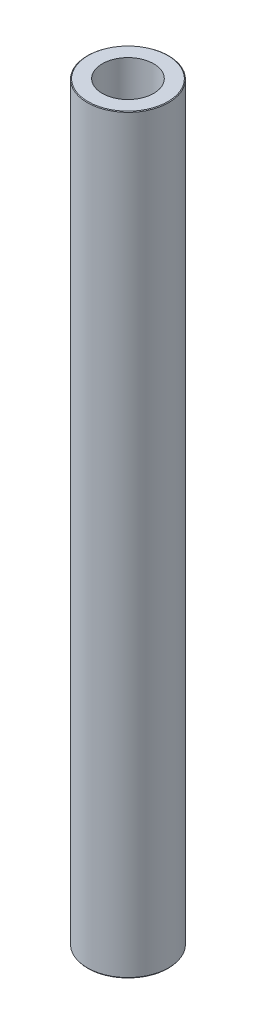
ISO-10303-21;
HEADER;
FILE_DESCRIPTION(('STEP AP214'),'2;1');
FILE_NAME('part.step','',(''),(''),'','','');
FILE_SCHEMA(('AUTOMOTIVE_DESIGN { 1 0 10303 214 1 1 1 1 }'));
ENDSEC;
DATA;
#1=APPLICATION_CONTEXT('core data for automotive mechanical design processes');
#2=APPLICATION_PROTOCOL_DEFINITION('international standard','automotive_design',2000,#1);
#3=PRODUCT_CONTEXT('',#1,'mechanical');
#4=PRODUCT('Part','Part','',(#3));
#5=PRODUCT_RELATED_PRODUCT_CATEGORY('part','',(#4));
#6=PRODUCT_DEFINITION_FORMATION('','',#4);
#7=PRODUCT_DEFINITION_CONTEXT('part definition',#1,'design');
#8=PRODUCT_DEFINITION('design','',#6,#7);
#9=PRODUCT_DEFINITION_SHAPE('','',#8);
#10=(LENGTH_UNIT() NAMED_UNIT(*) SI_UNIT(.MILLI.,.METRE.));
#11=(NAMED_UNIT(*) PLANE_ANGLE_UNIT() SI_UNIT($,.RADIAN.));
#12=(NAMED_UNIT(*) SI_UNIT($,.STERADIAN.) SOLID_ANGLE_UNIT());
#13=UNCERTAINTY_MEASURE_WITH_UNIT(LENGTH_MEASURE(1.E-05),#10,'distance_accuracy_value','');
#14=(GEOMETRIC_REPRESENTATION_CONTEXT(3) GLOBAL_UNCERTAINTY_ASSIGNED_CONTEXT((#13)) GLOBAL_UNIT_ASSIGNED_CONTEXT((#10,
#11,#12)) REPRESENTATION_CONTEXT('',''));
#15=CARTESIAN_POINT('',(0.,0.,0.));
#16=DIRECTION('',(0.,0.,1.));
#17=DIRECTION('',(1.,0.,0.));
#18=AXIS2_PLACEMENT_3D('',#15,#16,#17);
#19=CARTESIAN_POINT('',(0.,600.,0.));
#20=DIRECTION('',(0.,-1.,0.));
#21=DIRECTION('',(0.,0.,-1.));
#22=AXIS2_PLACEMENT_3D('',#19,#20,#21);
#23=CYLINDRICAL_SURFACE('',#22,32.5);
#24=CARTESIAN_POINT('',(0.,599.567925164357,0.));
#25=DIRECTION('',(0.,1.,0.));
#26=DIRECTION('',(0.,0.,1.));
#27=AXIS2_PLACEMENT_3D('',#24,#25,#26);
#28=CIRCLE('',#27,32.5);
#29=CARTESIAN_POINT('',(0.,599.567925164357,32.5));
#30=VERTEX_POINT('',#29);
#31=EDGE_CURVE('E50',#30,#30,#28,.F.);
#32=ORIENTED_EDGE('',*,*,#31,.T.);
#33=EDGE_LOOP('',(#32));
#34=FACE_BOUND('',#33,.T.);
#35=CARTESIAN_POINT('',(0.,0.597846862721241,0.));
#36=DIRECTION('',(0.,1.,0.));
#37=DIRECTION('',(0.,0.,1.));
#38=AXIS2_PLACEMENT_3D('',#35,#36,#37);
#39=CIRCLE('',#38,32.5);
#40=CARTESIAN_POINT('',(0.,0.597846862721241,32.5));
#41=VERTEX_POINT('',#40);
#42=EDGE_CURVE('E51',#41,#41,#39,.T.);
#43=ORIENTED_EDGE('',*,*,#42,.T.);
#44=EDGE_LOOP('',(#43));
#45=FACE_BOUND('',#44,.T.);
#46=ADVANCED_FACE('F39',(#34,#45),#23,.T.);
#47=CARTESIAN_POINT('',(0.,600.,0.));
#48=DIRECTION('',(0.,1.,0.));
#49=DIRECTION('',(0.,0.,1.));
#50=AXIS2_PLACEMENT_3D('',#47,#48,#49);
#51=PLANE('',#50);
#52=CARTESIAN_POINT('',(0.,600.,0.));
#53=DIRECTION('',(0.,1.,0.));
#54=DIRECTION('',(0.,0.,1.));
#55=AXIS2_PLACEMENT_3D('',#52,#53,#54);
#56=CIRCLE('',#55,31.9021531372786);
#57=CARTESIAN_POINT('',(0.,600.,31.9021531372786));
#58=VERTEX_POINT('',#57);
#59=EDGE_CURVE('E54',#58,#58,#56,.T.);
#60=ORIENTED_EDGE('',*,*,#59,.T.);
#61=EDGE_LOOP('',(#60));
#62=FACE_BOUND('',#61,.T.);
#63=CARTESIAN_POINT('',(0.,600.,0.));
#64=DIRECTION('',(0.,1.,0.));
#65=DIRECTION('',(0.,0.,1.));
#66=AXIS2_PLACEMENT_3D('',#63,#64,#65);
#67=CIRCLE('',#66,20.5595150408442);
#68=CARTESIAN_POINT('',(0.,600.,20.5595150408442));
#69=VERTEX_POINT('',#68);
#70=EDGE_CURVE('E58',#69,#69,#67,.T.);
#71=ORIENTED_EDGE('',*,*,#70,.F.);
#72=EDGE_LOOP('',(#71));
#73=FACE_BOUND('',#72,.T.);
#74=ADVANCED_FACE('F69',(#62,#73),#51,.T.);
#75=CARTESIAN_POINT('',(0.,0.,0.));
#76=DIRECTION('',(0.,1.,0.));
#77=DIRECTION('',(0.,0.,1.));
#78=AXIS2_PLACEMENT_3D('',#75,#76,#77);
#79=PLANE('',#78);
#80=CARTESIAN_POINT('',(0.,0.,0.));
#81=DIRECTION('',(0.,1.,0.));
#82=DIRECTION('',(0.,0.,1.));
#83=AXIS2_PLACEMENT_3D('',#80,#81,#82);
#84=CIRCLE('',#83,32.0679251643573);
#85=CARTESIAN_POINT('',(0.,0.,32.0679251643573));
#86=VERTEX_POINT('',#85);
#87=EDGE_CURVE('E10',#86,#86,#84,.F.);
#88=ORIENTED_EDGE('',*,*,#87,.T.);
#89=EDGE_LOOP('',(#88));
#90=FACE_BOUND('',#89,.T.);
#91=CARTESIAN_POINT('',(0.,0.,0.));
#92=DIRECTION('',(0.,1.,0.));
#93=DIRECTION('',(0.,0.,1.));
#94=AXIS2_PLACEMENT_3D('',#91,#92,#93);
#95=CIRCLE('',#94,20.5595150408442);
#96=CARTESIAN_POINT('',(0.,0.,20.5595150408442));
#97=VERTEX_POINT('',#96);
#98=EDGE_CURVE('E63',#97,#97,#95,.T.);
#99=ORIENTED_EDGE('',*,*,#98,.T.);
#100=EDGE_LOOP('',(#99));
#101=FACE_BOUND('',#100,.T.);
#102=ADVANCED_FACE('F75',(#90,#101),#79,.F.);
#103=CARTESIAN_POINT('',(0.,600.,0.));
#104=DIRECTION('',(0.,-1.,0.));
#105=DIRECTION('',(0.,0.,-1.));
#106=AXIS2_PLACEMENT_3D('',#103,#104,#105);
#107=CYLINDRICAL_SURFACE('',#106,20.5595150408442);
#108=ORIENTED_EDGE('',*,*,#70,.T.);
#109=EDGE_LOOP('',(#108));
#110=FACE_BOUND('',#109,.T.);
#111=ORIENTED_EDGE('',*,*,#98,.F.);
#112=EDGE_LOOP('',(#111));
#113=FACE_BOUND('',#112,.T.);
#114=ADVANCED_FACE('F70',(#110,#113),#107,.F.);
#115=CARTESIAN_POINT('',(0.,600.,0.));
#116=DIRECTION('',(0.,-1.,0.));
#117=DIRECTION('',(0.,0.,-1.));
#118=AXIS2_PLACEMENT_3D('',#115,#116,#117);
#119=CONICAL_SURFACE('',#118,31.9021531372786,0.944985376464083);
#120=ORIENTED_EDGE('',*,*,#31,.F.);
#121=EDGE_LOOP('',(#120));
#122=FACE_BOUND('',#121,.T.);
#123=ORIENTED_EDGE('',*,*,#59,.F.);
#124=EDGE_LOOP('',(#123));
#125=FACE_BOUND('',#124,.T.);
#126=ADVANCED_FACE('F81',(#122,#125),#119,.T.);
#127=CARTESIAN_POINT('',(0.,0.597846862721241,0.));
#128=DIRECTION('',(0.,1.,0.));
#129=DIRECTION('',(0.,0.,1.));
#130=AXIS2_PLACEMENT_3D('',#127,#128,#129);
#131=CONICAL_SURFACE('',#130,32.5,0.625810950330755);
#132=ORIENTED_EDGE('',*,*,#87,.F.);
#133=EDGE_LOOP('',(#132));
#134=FACE_BOUND('',#133,.T.);
#135=ORIENTED_EDGE('',*,*,#42,.F.);
#136=EDGE_LOOP('',(#135));
#137=FACE_BOUND('',#136,.T.);
#138=ADVANCED_FACE('F45',(#134,#137),#131,.T.);
#139=CLOSED_SHELL('',(#46,#74,#102,#114,#126,#138));
#140=MANIFOLD_SOLID_BREP('B2',#139);
#141=ADVANCED_BREP_SHAPE_REPRESENTATION('',(#18,#140),#14);
#142=SHAPE_DEFINITION_REPRESENTATION(#9,#141);
ENDSEC;
END-ISO-10303-21;
